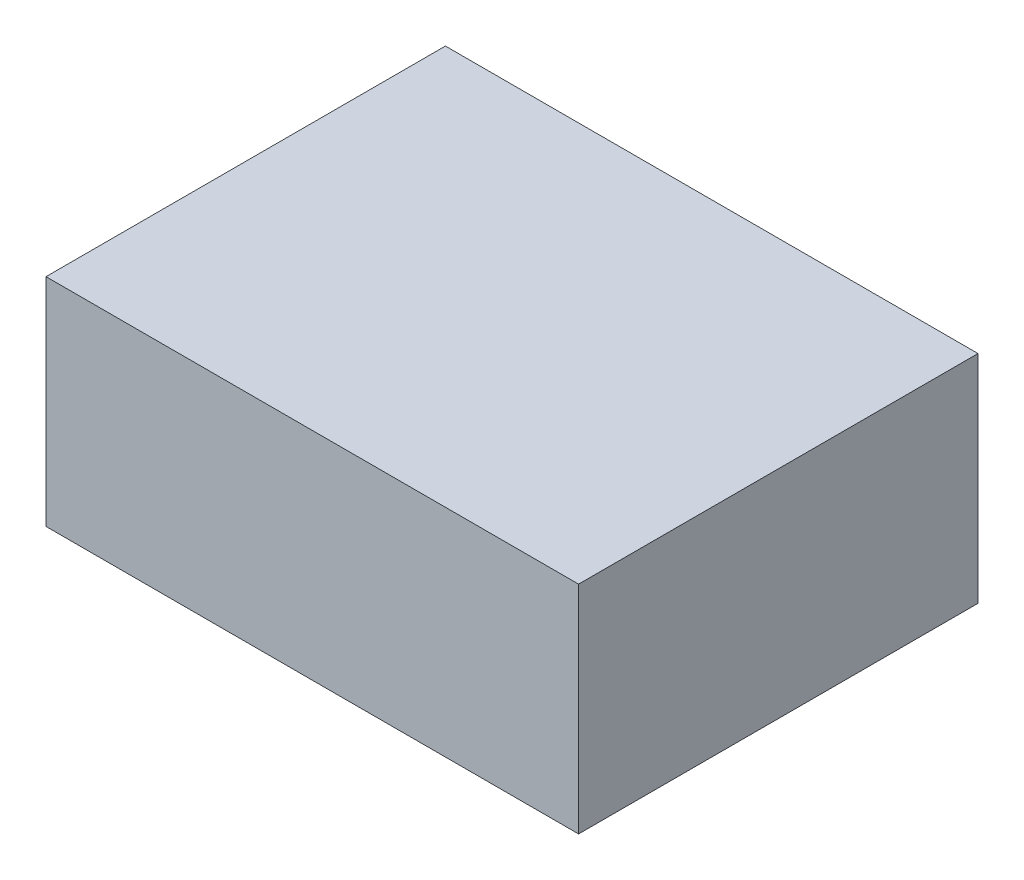
ISO-10303-21;
HEADER;
FILE_DESCRIPTION(('STEP AP214'),'2;1');
FILE_NAME('part.step','',(''),(''),'','','');
FILE_SCHEMA(('AUTOMOTIVE_DESIGN { 1 0 10303 214 1 1 1 1 }'));
ENDSEC;
DATA;
#1=APPLICATION_CONTEXT('core data for automotive mechanical design processes');
#2=APPLICATION_PROTOCOL_DEFINITION('international standard','automotive_design',2000,#1);
#3=PRODUCT_CONTEXT('',#1,'mechanical');
#4=PRODUCT('Part','Part','',(#3));
#5=PRODUCT_RELATED_PRODUCT_CATEGORY('part','',(#4));
#6=PRODUCT_DEFINITION_FORMATION('','',#4);
#7=PRODUCT_DEFINITION_CONTEXT('part definition',#1,'design');
#8=PRODUCT_DEFINITION('design','',#6,#7);
#9=PRODUCT_DEFINITION_SHAPE('','',#8);
#10=(LENGTH_UNIT() NAMED_UNIT(*) SI_UNIT(.MILLI.,.METRE.));
#11=(NAMED_UNIT(*) PLANE_ANGLE_UNIT() SI_UNIT($,.RADIAN.));
#12=(NAMED_UNIT(*) SI_UNIT($,.STERADIAN.) SOLID_ANGLE_UNIT());
#13=UNCERTAINTY_MEASURE_WITH_UNIT(LENGTH_MEASURE(1.E-05),#10,'distance_accuracy_value','');
#14=(GEOMETRIC_REPRESENTATION_CONTEXT(3) GLOBAL_UNCERTAINTY_ASSIGNED_CONTEXT((#13)) GLOBAL_UNIT_ASSIGNED_CONTEXT((#10,
#11,#12)) REPRESENTATION_CONTEXT('',''));
#15=CARTESIAN_POINT('',(0.,0.,0.));
#16=DIRECTION('',(0.,0.,1.));
#17=DIRECTION('',(1.,0.,0.));
#18=AXIS2_PLACEMENT_3D('',#15,#16,#17);
#19=CARTESIAN_POINT('',(203.2,165.1,-152.4));
#20=DIRECTION('',(-1.,0.,0.));
#21=DIRECTION('',(0.,0.,1.));
#22=AXIS2_PLACEMENT_3D('',#19,#20,#21);
#23=PLANE('',#22);
#24=DIRECTION('',(0.,0.,-1.));
#25=VECTOR('',#24,1.);
#26=CARTESIAN_POINT('',(203.2,0.,-152.4));
#27=LINE('',#26,#25);
#28=CARTESIAN_POINT('',(203.2,0.,152.4));
#29=VERTEX_POINT('',#28);
#30=CARTESIAN_POINT('',(203.2,0.,-152.4));
#31=VERTEX_POINT('',#30);
#32=EDGE_CURVE('E107',#29,#31,#27,.T.);
#33=ORIENTED_EDGE('',*,*,#32,.T.);
#34=DIRECTION('',(0.,-1.,0.));
#35=VECTOR('',#34,1.);
#36=CARTESIAN_POINT('',(203.2,165.1,-152.4));
#37=LINE('',#36,#35);
#38=CARTESIAN_POINT('',(203.2,165.1,-152.4));
#39=VERTEX_POINT('',#38);
#40=EDGE_CURVE('E11',#39,#31,#37,.T.);
#41=ORIENTED_EDGE('',*,*,#40,.F.);
#42=DIRECTION('',(0.,0.,-1.));
#43=VECTOR('',#42,1.);
#44=CARTESIAN_POINT('',(203.2,165.1,-152.4));
#45=LINE('',#44,#43);
#46=CARTESIAN_POINT('',(203.2,165.1,152.4));
#47=VERTEX_POINT('',#46);
#48=EDGE_CURVE('E91',#47,#39,#45,.T.);
#49=ORIENTED_EDGE('',*,*,#48,.F.);
#50=DIRECTION('',(0.,-1.,0.));
#51=VECTOR('',#50,1.);
#52=CARTESIAN_POINT('',(203.2,165.1,152.4));
#53=LINE('',#52,#51);
#54=EDGE_CURVE('E103',#47,#29,#53,.T.);
#55=ORIENTED_EDGE('',*,*,#54,.T.);
#56=EDGE_LOOP('',(#33,#41,#49,#55));
#57=FACE_BOUND('',#56,.T.);
#58=ADVANCED_FACE('F39',(#57),#23,.F.);
#59=CARTESIAN_POINT('',(-203.2,165.1,-152.4));
#60=DIRECTION('',(0.,0.,1.));
#61=DIRECTION('',(1.,0.,0.));
#62=AXIS2_PLACEMENT_3D('',#59,#60,#61);
#63=PLANE('',#62);
#64=DIRECTION('',(-1.,0.,0.));
#65=VECTOR('',#64,1.);
#66=CARTESIAN_POINT('',(-203.2,0.,-152.4));
#67=LINE('',#66,#65);
#68=CARTESIAN_POINT('',(-203.2,0.,-152.4));
#69=VERTEX_POINT('',#68);
#70=EDGE_CURVE('E96',#31,#69,#67,.T.);
#71=ORIENTED_EDGE('',*,*,#70,.T.);
#72=DIRECTION('',(0.,-1.,0.));
#73=VECTOR('',#72,1.);
#74=CARTESIAN_POINT('',(-203.2,165.1,-152.4));
#75=LINE('',#74,#73);
#76=CARTESIAN_POINT('',(-203.2,165.1,-152.4));
#77=VERTEX_POINT('',#76);
#78=EDGE_CURVE('E48',#77,#69,#75,.T.);
#79=ORIENTED_EDGE('',*,*,#78,.F.);
#80=DIRECTION('',(-1.,0.,0.));
#81=VECTOR('',#80,1.);
#82=CARTESIAN_POINT('',(-203.2,165.1,-152.4));
#83=LINE('',#82,#81);
#84=EDGE_CURVE('E86',#39,#77,#83,.T.);
#85=ORIENTED_EDGE('',*,*,#84,.F.);
#86=ORIENTED_EDGE('',*,*,#40,.T.);
#87=EDGE_LOOP('',(#71,#79,#85,#86));
#88=FACE_BOUND('',#87,.T.);
#89=ADVANCED_FACE('F95',(#88),#63,.F.);
#90=CARTESIAN_POINT('',(-203.2,165.1,-152.4));
#91=DIRECTION('',(1.,0.,0.));
#92=DIRECTION('',(0.,0.,-1.));
#93=AXIS2_PLACEMENT_3D('',#90,#91,#92);
#94=PLANE('',#93);
#95=DIRECTION('',(0.,0.,1.));
#96=VECTOR('',#95,1.);
#97=CARTESIAN_POINT('',(-203.2,0.,-152.4));
#98=LINE('',#97,#96);
#99=CARTESIAN_POINT('',(-203.2,0.,152.4));
#100=VERTEX_POINT('',#99);
#101=EDGE_CURVE('E73',#69,#100,#98,.T.);
#102=ORIENTED_EDGE('',*,*,#101,.T.);
#103=DIRECTION('',(0.,-1.,0.));
#104=VECTOR('',#103,1.);
#105=CARTESIAN_POINT('',(-203.2,165.1,152.4));
#106=LINE('',#105,#104);
#107=CARTESIAN_POINT('',(-203.2,165.1,152.4));
#108=VERTEX_POINT('',#107);
#109=EDGE_CURVE('E98',#108,#100,#106,.T.);
#110=ORIENTED_EDGE('',*,*,#109,.F.);
#111=DIRECTION('',(0.,0.,1.));
#112=VECTOR('',#111,1.);
#113=CARTESIAN_POINT('',(-203.2,165.1,-152.4));
#114=LINE('',#113,#112);
#115=EDGE_CURVE('E89',#77,#108,#114,.T.);
#116=ORIENTED_EDGE('',*,*,#115,.F.);
#117=ORIENTED_EDGE('',*,*,#78,.T.);
#118=EDGE_LOOP('',(#102,#110,#116,#117));
#119=FACE_BOUND('',#118,.T.);
#120=ADVANCED_FACE('F99',(#119),#94,.F.);
#121=CARTESIAN_POINT('',(-203.2,165.1,152.4));
#122=DIRECTION('',(0.,0.,-1.));
#123=DIRECTION('',(-1.,0.,0.));
#124=AXIS2_PLACEMENT_3D('',#121,#122,#123);
#125=PLANE('',#124);
#126=DIRECTION('',(1.,0.,0.));
#127=VECTOR('',#126,1.);
#128=CARTESIAN_POINT('',(-203.2,0.,152.4));
#129=LINE('',#128,#127);
#130=EDGE_CURVE('E79',#100,#29,#129,.T.);
#131=ORIENTED_EDGE('',*,*,#130,.T.);
#132=ORIENTED_EDGE('',*,*,#54,.F.);
#133=DIRECTION('',(1.,0.,0.));
#134=VECTOR('',#133,1.);
#135=CARTESIAN_POINT('',(-203.2,165.1,152.4));
#136=LINE('',#135,#134);
#137=EDGE_CURVE('E56',#108,#47,#136,.T.);
#138=ORIENTED_EDGE('',*,*,#137,.F.);
#139=ORIENTED_EDGE('',*,*,#109,.T.);
#140=EDGE_LOOP('',(#131,#132,#138,#139));
#141=FACE_BOUND('',#140,.T.);
#142=ADVANCED_FACE('F120',(#141),#125,.F.);
#143=CARTESIAN_POINT('',(0.,165.1,0.));
#144=DIRECTION('',(0.,1.,0.));
#145=DIRECTION('',(0.,0.,1.));
#146=AXIS2_PLACEMENT_3D('',#143,#144,#145);
#147=PLANE('',#146);
#148=ORIENTED_EDGE('',*,*,#48,.T.);
#149=ORIENTED_EDGE('',*,*,#84,.T.);
#150=ORIENTED_EDGE('',*,*,#115,.T.);
#151=ORIENTED_EDGE('',*,*,#137,.T.);
#152=EDGE_LOOP('',(#148,#149,#150,#151));
#153=FACE_BOUND('',#152,.T.);
#154=ADVANCED_FACE('F87',(#153),#147,.T.);
#155=CARTESIAN_POINT('',(0.,0.,0.));
#156=DIRECTION('',(0.,1.,0.));
#157=DIRECTION('',(0.,0.,1.));
#158=AXIS2_PLACEMENT_3D('',#155,#156,#157);
#159=PLANE('',#158);
#160=ORIENTED_EDGE('',*,*,#32,.F.);
#161=ORIENTED_EDGE('',*,*,#130,.F.);
#162=ORIENTED_EDGE('',*,*,#101,.F.);
#163=ORIENTED_EDGE('',*,*,#70,.F.);
#164=EDGE_LOOP('',(#160,#161,#162,#163));
#165=FACE_BOUND('',#164,.T.);
#166=ADVANCED_FACE('F123',(#165),#159,.F.);
#167=CLOSED_SHELL('',(#58,#89,#120,#142,#154,#166));
#168=MANIFOLD_SOLID_BREP('B2',#167);
#169=ADVANCED_BREP_SHAPE_REPRESENTATION('',(#18,#168),#14);
#170=SHAPE_DEFINITION_REPRESENTATION(#9,#169);
ENDSEC;
END-ISO-10303-21;
